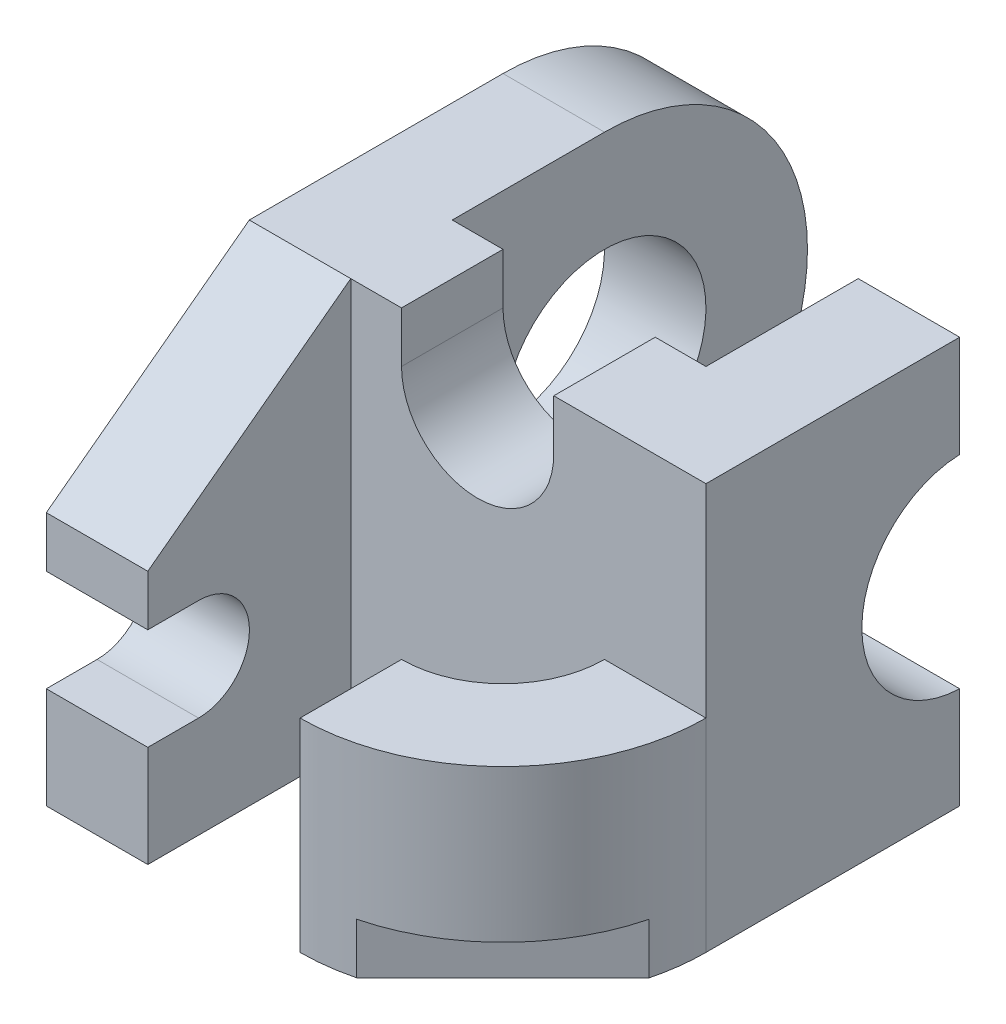
ISO-10303-21;
HEADER;
FILE_DESCRIPTION(('STEP AP214'),'2;1');
FILE_NAME('part.step','',(''),(''),'','','');
FILE_SCHEMA(('AUTOMOTIVE_DESIGN { 1 0 10303 214 1 1 1 1 }'));
ENDSEC;
DATA;
#1=APPLICATION_CONTEXT('core data for automotive mechanical design processes');
#2=APPLICATION_PROTOCOL_DEFINITION('international standard','automotive_design',2000,#1);
#3=PRODUCT_CONTEXT('',#1,'mechanical');
#4=PRODUCT('Part','Part','',(#3));
#5=PRODUCT_RELATED_PRODUCT_CATEGORY('part','',(#4));
#6=PRODUCT_DEFINITION_FORMATION('','',#4);
#7=PRODUCT_DEFINITION_CONTEXT('part definition',#1,'design');
#8=PRODUCT_DEFINITION('design','',#6,#7);
#9=PRODUCT_DEFINITION_SHAPE('','',#8);
#10=(LENGTH_UNIT() NAMED_UNIT(*) SI_UNIT(.MILLI.,.METRE.));
#11=(NAMED_UNIT(*) PLANE_ANGLE_UNIT() SI_UNIT($,.RADIAN.));
#12=(NAMED_UNIT(*) SI_UNIT($,.STERADIAN.) SOLID_ANGLE_UNIT());
#13=UNCERTAINTY_MEASURE_WITH_UNIT(LENGTH_MEASURE(1.E-05),#10,'distance_accuracy_value','');
#14=(GEOMETRIC_REPRESENTATION_CONTEXT(3) GLOBAL_UNCERTAINTY_ASSIGNED_CONTEXT((#13)) GLOBAL_UNIT_ASSIGNED_CONTEXT((#10,
#11,#12)) REPRESENTATION_CONTEXT('',''));
#15=CARTESIAN_POINT('',(0.,0.,0.));
#16=DIRECTION('',(0.,0.,1.));
#17=DIRECTION('',(1.,0.,0.));
#18=AXIS2_PLACEMENT_3D('',#15,#16,#17);
#19=CARTESIAN_POINT('',(-1.5,-1.,2.));
#20=DIRECTION('',(0.,0.,1.));
#21=DIRECTION('',(1.,0.,0.));
#22=AXIS2_PLACEMENT_3D('',#19,#20,#21);
#23=PLANE('',#22);
#24=DIRECTION('',(0.,-1.,0.));
#25=VECTOR('',#24,1.);
#26=CARTESIAN_POINT('',(1.,-4.,2.));
#27=LINE('',#26,#25);
#28=CARTESIAN_POINT('',(1.,-4.,2.));
#29=VERTEX_POINT('',#28);
#30=CARTESIAN_POINT('',(1.,-8.,2.));
#31=VERTEX_POINT('',#30);
#32=EDGE_CURVE('E57',#29,#31,#27,.T.);
#33=ORIENTED_EDGE('',*,*,#32,.F.);
#34=DIRECTION('',(1.,0.,0.));
#35=VECTOR('',#34,1.);
#36=CARTESIAN_POINT('',(3.,-4.,2.));
#37=LINE('',#36,#35);
#38=CARTESIAN_POINT('',(3.,-4.,2.));
#39=VERTEX_POINT('',#38);
#40=EDGE_CURVE('E237',#29,#39,#37,.T.);
#41=ORIENTED_EDGE('',*,*,#40,.T.);
#42=DIRECTION('',(0.,1.,0.));
#43=VECTOR('',#42,1.);
#44=CARTESIAN_POINT('',(3.,-8.,2.));
#45=LINE('',#44,#43);
#46=CARTESIAN_POINT('',(3.,0.,2.));
#47=VERTEX_POINT('',#46);
#48=EDGE_CURVE('E309',#39,#47,#45,.T.);
#49=ORIENTED_EDGE('',*,*,#48,.T.);
#50=DIRECTION('',(-1.,0.,0.));
#51=VECTOR('',#50,1.);
#52=CARTESIAN_POINT('',(3.,0.,2.));
#53=LINE('',#52,#51);
#54=CARTESIAN_POINT('',(0.,0.,2.));
#55=VERTEX_POINT('',#54);
#56=EDGE_CURVE('E326',#47,#55,#53,.T.);
#57=ORIENTED_EDGE('',*,*,#56,.T.);
#58=DIRECTION('',(0.,-1.,0.));
#59=VECTOR('',#58,1.);
#60=CARTESIAN_POINT('',(0.,0.,2.));
#61=LINE('',#60,#59);
#62=CARTESIAN_POINT('',(0.,-1.,2.));
#63=VERTEX_POINT('',#62);
#64=EDGE_CURVE('E328',#55,#63,#61,.T.);
#65=ORIENTED_EDGE('',*,*,#64,.T.);
#66=CARTESIAN_POINT('',(-1.5,-1.,2.));
#67=DIRECTION('',(0.,0.,-1.));
#68=DIRECTION('',(1.,0.,0.));
#69=AXIS2_PLACEMENT_3D('',#66,#67,#68);
#70=CIRCLE('',#69,1.5);
#71=CARTESIAN_POINT('',(-3.,-1.,2.));
#72=VERTEX_POINT('',#71);
#73=EDGE_CURVE('E330',#63,#72,#70,.T.);
#74=ORIENTED_EDGE('',*,*,#73,.T.);
#75=DIRECTION('',(0.,1.,0.));
#76=VECTOR('',#75,1.);
#77=CARTESIAN_POINT('',(-3.,0.,2.));
#78=LINE('',#77,#76);
#79=CARTESIAN_POINT('',(-3.,0.,2.));
#80=VERTEX_POINT('',#79);
#81=EDGE_CURVE('E305',#72,#80,#78,.T.);
#82=ORIENTED_EDGE('',*,*,#81,.T.);
#83=DIRECTION('',(-1.,0.,0.));
#84=VECTOR('',#83,1.);
#85=CARTESIAN_POINT('',(-3.,0.,2.));
#86=LINE('',#85,#84);
#87=CARTESIAN_POINT('',(-4.,0.,2.));
#88=VERTEX_POINT('',#87);
#89=EDGE_CURVE('E300',#80,#88,#86,.T.);
#90=ORIENTED_EDGE('',*,*,#89,.T.);
#91=DIRECTION('',(0.,-1.,0.));
#92=VECTOR('',#91,1.);
#93=CARTESIAN_POINT('',(-4.,-8.,2.));
#94=LINE('',#93,#92);
#95=CARTESIAN_POINT('',(-4.,-8.,2.));
#96=VERTEX_POINT('',#95);
#97=EDGE_CURVE('E274',#88,#96,#94,.T.);
#98=ORIENTED_EDGE('',*,*,#97,.T.);
#99=DIRECTION('',(1.,0.,0.));
#100=VECTOR('',#99,1.);
#101=CARTESIAN_POINT('',(-6.,-8.,2.));
#102=LINE('',#101,#100);
#103=EDGE_CURVE('E307',#96,#31,#102,.T.);
#104=ORIENTED_EDGE('',*,*,#103,.T.);
#105=EDGE_LOOP('',(#33,#41,#49,#57,#65,#74,#82,#90,#98,#104));
#106=FACE_BOUND('',#105,.T.);
#107=ADVANCED_FACE('F33',(#106),#23,.T.);
#108=CARTESIAN_POINT('',(-1.5,-1.,0.));
#109=DIRECTION('',(0.,0.,1.));
#110=DIRECTION('',(1.,0.,0.));
#111=AXIS2_PLACEMENT_3D('',#108,#109,#110);
#112=PLANE('',#111);
#113=DIRECTION('',(0.,1.,0.));
#114=VECTOR('',#113,1.);
#115=CARTESIAN_POINT('',(-4.,0.,0.));
#116=LINE('',#115,#114);
#117=CARTESIAN_POINT('',(-4.,-8.,0.));
#118=VERTEX_POINT('',#117);
#119=CARTESIAN_POINT('',(-4.,0.,0.));
#120=VERTEX_POINT('',#119);
#121=EDGE_CURVE('E449',#118,#120,#116,.T.);
#122=ORIENTED_EDGE('',*,*,#121,.T.);
#123=DIRECTION('',(-1.,0.,0.));
#124=VECTOR('',#123,1.);
#125=CARTESIAN_POINT('',(-3.,0.,0.));
#126=LINE('',#125,#124);
#127=CARTESIAN_POINT('',(-3.,0.,0.));
#128=VERTEX_POINT('',#127);
#129=EDGE_CURVE('E336',#128,#120,#126,.T.);
#130=ORIENTED_EDGE('',*,*,#129,.F.);
#131=DIRECTION('',(0.,1.,0.));
#132=VECTOR('',#131,1.);
#133=CARTESIAN_POINT('',(-3.,0.,0.));
#134=LINE('',#133,#132);
#135=CARTESIAN_POINT('',(-3.,-1.,0.));
#136=VERTEX_POINT('',#135);
#137=EDGE_CURVE('E333',#136,#128,#134,.T.);
#138=ORIENTED_EDGE('',*,*,#137,.F.);
#139=CARTESIAN_POINT('',(-1.5,-1.,0.));
#140=DIRECTION('',(0.,0.,-1.));
#141=DIRECTION('',(1.,0.,0.));
#142=AXIS2_PLACEMENT_3D('',#139,#140,#141);
#143=CIRCLE('',#142,1.5);
#144=CARTESIAN_POINT('',(0.,-1.,0.));
#145=VERTEX_POINT('',#144);
#146=EDGE_CURVE('E311',#145,#136,#143,.T.);
#147=ORIENTED_EDGE('',*,*,#146,.F.);
#148=DIRECTION('',(0.,-1.,0.));
#149=VECTOR('',#148,1.);
#150=CARTESIAN_POINT('',(0.,0.,0.));
#151=LINE('',#150,#149);
#152=CARTESIAN_POINT('',(0.,0.,0.));
#153=VERTEX_POINT('',#152);
#154=EDGE_CURVE('E342',#153,#145,#151,.T.);
#155=ORIENTED_EDGE('',*,*,#154,.F.);
#156=DIRECTION('',(-1.,0.,0.));
#157=VECTOR('',#156,1.);
#158=CARTESIAN_POINT('',(3.,0.,0.));
#159=LINE('',#158,#157);
#160=CARTESIAN_POINT('',(1.,0.,0.));
#161=VERTEX_POINT('',#160);
#162=EDGE_CURVE('E345',#161,#153,#159,.T.);
#163=ORIENTED_EDGE('',*,*,#162,.F.);
#164=DIRECTION('',(0.,-1.,0.));
#165=VECTOR('',#164,1.);
#166=CARTESIAN_POINT('',(1.,0.,0.));
#167=LINE('',#166,#165);
#168=CARTESIAN_POINT('',(1.,-8.,0.));
#169=VERTEX_POINT('',#168);
#170=EDGE_CURVE('E348',#161,#169,#167,.T.);
#171=ORIENTED_EDGE('',*,*,#170,.T.);
#172=DIRECTION('',(1.,0.,0.));
#173=VECTOR('',#172,1.);
#174=CARTESIAN_POINT('',(-6.,-8.,0.));
#175=LINE('',#174,#173);
#176=EDGE_CURVE('E315',#118,#169,#175,.T.);
#177=ORIENTED_EDGE('',*,*,#176,.F.);
#178=EDGE_LOOP('',(#122,#130,#138,#147,#155,#163,#171,#177));
#179=FACE_BOUND('',#178,.T.);
#180=ADVANCED_FACE('F404',(#179),#112,.F.);
#181=CARTESIAN_POINT('',(-3.,0.,2.));
#182=DIRECTION('',(-1.,0.,0.));
#183=DIRECTION('',(0.,-1.,0.));
#184=AXIS2_PLACEMENT_3D('',#181,#182,#183);
#185=PLANE('',#184);
#186=ORIENTED_EDGE('',*,*,#137,.T.);
#187=DIRECTION('',(0.,0.,-1.));
#188=VECTOR('',#187,1.);
#189=CARTESIAN_POINT('',(-3.,0.,2.));
#190=LINE('',#189,#188);
#191=EDGE_CURVE('E11',#80,#128,#190,.T.);
#192=ORIENTED_EDGE('',*,*,#191,.F.);
#193=ORIENTED_EDGE('',*,*,#81,.F.);
#194=DIRECTION('',(0.,0.,-1.));
#195=VECTOR('',#194,1.);
#196=CARTESIAN_POINT('',(-3.,-1.,2.));
#197=LINE('',#196,#195);
#198=EDGE_CURVE('E332',#72,#136,#197,.T.);
#199=ORIENTED_EDGE('',*,*,#198,.T.);
#200=EDGE_LOOP('',(#186,#192,#193,#199));
#201=FACE_BOUND('',#200,.T.);
#202=ADVANCED_FACE('F35',(#201),#185,.F.);
#203=CARTESIAN_POINT('',(-3.,0.,2.));
#204=DIRECTION('',(0.,-1.,0.));
#205=DIRECTION('',(1.,0.,0.));
#206=AXIS2_PLACEMENT_3D('',#203,#204,#205);
#207=PLANE('',#206);
#208=ORIENTED_EDGE('',*,*,#129,.T.);
#209=DIRECTION('',(0.,0.,-1.));
#210=VECTOR('',#209,1.);
#211=CARTESIAN_POINT('',(-4.,0.,-3.));
#212=LINE('',#211,#210);
#213=CARTESIAN_POINT('',(-4.,0.,-3.));
#214=VERTEX_POINT('',#213);
#215=EDGE_CURVE('E433',#120,#214,#212,.T.);
#216=ORIENTED_EDGE('',*,*,#215,.T.);
#217=DIRECTION('',(-1.,0.,0.));
#218=VECTOR('',#217,1.);
#219=CARTESIAN_POINT('',(-4.,0.,-3.));
#220=LINE('',#219,#218);
#221=CARTESIAN_POINT('',(-6.,0.,-3.));
#222=VERTEX_POINT('',#221);
#223=EDGE_CURVE('E374',#214,#222,#220,.T.);
#224=ORIENTED_EDGE('',*,*,#223,.T.);
#225=DIRECTION('',(0.,0.,-1.));
#226=VECTOR('',#225,1.);
#227=CARTESIAN_POINT('',(-6.,0.,2.));
#228=LINE('',#227,#226);
#229=CARTESIAN_POINT('',(-6.,0.,2.));
#230=VERTEX_POINT('',#229);
#231=EDGE_CURVE('E42',#230,#222,#228,.T.);
#232=ORIENTED_EDGE('',*,*,#231,.F.);
#233=DIRECTION('',(-1.,0.,0.));
#234=VECTOR('',#233,1.);
#235=CARTESIAN_POINT('',(-4.,0.,2.));
#236=LINE('',#235,#234);
#237=EDGE_CURVE('E281',#88,#230,#236,.T.);
#238=ORIENTED_EDGE('',*,*,#237,.F.);
#239=ORIENTED_EDGE('',*,*,#89,.F.);
#240=ORIENTED_EDGE('',*,*,#191,.T.);
#241=EDGE_LOOP('',(#208,#216,#224,#232,#238,#239,#240));
#242=FACE_BOUND('',#241,.T.);
#243=ADVANCED_FACE('F299',(#242),#207,.F.);
#244=CARTESIAN_POINT('',(-6.,0.,2.));
#245=DIRECTION('',(1.,0.,0.));
#246=DIRECTION('',(0.,1.,0.));
#247=AXIS2_PLACEMENT_3D('',#244,#245,#246);
#248=PLANE('',#247);
#249=ORIENTED_EDGE('',*,*,#231,.T.);
#250=CARTESIAN_POINT('',(-6.,-4.,-3.));
#251=DIRECTION('',(-1.,0.,0.));
#252=DIRECTION('',(0.,-1.,0.));
#253=AXIS2_PLACEMENT_3D('',#250,#251,#252);
#254=CIRCLE('',#253,4.);
#255=CARTESIAN_POINT('',(-6.,-8.,-3.));
#256=VERTEX_POINT('',#255);
#257=EDGE_CURVE('E430',#222,#256,#254,.T.);
#258=ORIENTED_EDGE('',*,*,#257,.T.);
#259=DIRECTION('',(0.,0.,-1.));
#260=VECTOR('',#259,1.);
#261=CARTESIAN_POINT('',(-6.,-8.,2.));
#262=LINE('',#261,#260);
#263=CARTESIAN_POINT('',(-6.,-8.,6.));
#264=VERTEX_POINT('',#263);
#265=EDGE_CURVE('E424',#264,#256,#262,.T.);
#266=ORIENTED_EDGE('',*,*,#265,.F.);
#267=DIRECTION('',(0.,1.,0.));
#268=VECTOR('',#267,1.);
#269=CARTESIAN_POINT('',(-6.,-8.,6.));
#270=LINE('',#269,#268);
#271=CARTESIAN_POINT('',(-6.,-6.,6.));
#272=VERTEX_POINT('',#271);
#273=EDGE_CURVE('E249',#264,#272,#270,.T.);
#274=ORIENTED_EDGE('',*,*,#273,.T.);
#275=DIRECTION('',(0.,0.,-1.));
#276=VECTOR('',#275,1.);
#277=CARTESIAN_POINT('',(-6.,-6.,6.));
#278=LINE('',#277,#276);
#279=CARTESIAN_POINT('',(-6.,-6.,5.));
#280=VERTEX_POINT('',#279);
#281=EDGE_CURVE('E474',#272,#280,#278,.T.);
#282=ORIENTED_EDGE('',*,*,#281,.T.);
#283=CARTESIAN_POINT('',(-6.,-4.99719330203454,5.));
#284=DIRECTION('',(1.,0.,0.));
#285=DIRECTION('',(0.,-1.,0.));
#286=AXIS2_PLACEMENT_3D('',#283,#284,#285);
#287=CIRCLE('',#286,1.00280669796546);
#288=CARTESIAN_POINT('',(-6.,-3.99438660406909,5.));
#289=VERTEX_POINT('',#288);
#290=EDGE_CURVE('E472',#280,#289,#287,.T.);
#291=ORIENTED_EDGE('',*,*,#290,.T.);
#292=DIRECTION('',(0.,0.,1.));
#293=VECTOR('',#292,1.);
#294=CARTESIAN_POINT('',(-6.,-3.99438660406909,6.));
#295=LINE('',#294,#293);
#296=CARTESIAN_POINT('',(-6.,-3.99438660406909,6.));
#297=VERTEX_POINT('',#296);
#298=EDGE_CURVE('E469',#289,#297,#295,.T.);
#299=ORIENTED_EDGE('',*,*,#298,.T.);
#300=DIRECTION('',(0.,1.,0.));
#301=VECTOR('',#300,1.);
#302=CARTESIAN_POINT('',(-6.,-2.99438660406909,6.));
#303=LINE('',#302,#301);
#304=CARTESIAN_POINT('',(-6.,-2.99438660406909,6.));
#305=VERTEX_POINT('',#304);
#306=EDGE_CURVE('E467',#297,#305,#303,.T.);
#307=ORIENTED_EDGE('',*,*,#306,.T.);
#308=DIRECTION('',(0.,0.59928075896345,-0.800538925934393));
#309=VECTOR('',#308,1.);
#310=CARTESIAN_POINT('',(-6.,0.,2.));
#311=LINE('',#310,#309);
#312=EDGE_CURVE('E257',#305,#230,#311,.T.);
#313=ORIENTED_EDGE('',*,*,#312,.T.);
#314=EDGE_LOOP('',(#249,#258,#266,#274,#282,#291,#299,#307,#313));
#315=FACE_BOUND('',#314,.T.);
#316=CARTESIAN_POINT('',(-6.,-4.,-3.));
#317=DIRECTION('',(-1.,0.,0.));
#318=DIRECTION('',(0.,-1.,0.));
#319=AXIS2_PLACEMENT_3D('',#316,#317,#318);
#320=CIRCLE('',#319,2.);
#321=CARTESIAN_POINT('',(-6.,-6.,-3.));
#322=VERTEX_POINT('',#321);
#323=EDGE_CURVE('E445',#322,#322,#320,.T.);
#324=ORIENTED_EDGE('',*,*,#323,.F.);
#325=EDGE_LOOP('',(#324));
#326=FACE_BOUND('',#325,.T.);
#327=ADVANCED_FACE('F427',(#315,#326),#248,.F.);
#328=CARTESIAN_POINT('',(-6.,-8.,2.));
#329=DIRECTION('',(0.,1.,0.));
#330=DIRECTION('',(0.,0.,1.));
#331=AXIS2_PLACEMENT_3D('',#328,#329,#330);
#332=PLANE('',#331);
#333=CARTESIAN_POINT('',(-1.00000000000002,-8.,1.99999999999998));
#334=DIRECTION('',(0.,-1.,0.));
#335=DIRECTION('',(0.,0.,1.));
#336=AXIS2_PLACEMENT_3D('',#333,#334,#335);
#337=CIRCLE('',#336,4.00000000000002);
#338=CARTESIAN_POINT('',(3.,-8.,2.));
#339=VERTEX_POINT('',#338);
#340=CARTESIAN_POINT('',(2.87298334620742,-8.,2.99999999999998));
#341=VERTEX_POINT('',#340);
#342=EDGE_CURVE('E240',#339,#341,#337,.T.);
#343=ORIENTED_EDGE('',*,*,#342,.T.);
#344=DIRECTION('',(0.70782222041372,0.,-0.706390617356));
#345=VECTOR('',#344,1.);
#346=CARTESIAN_POINT('',(-0.0078432583507787,-8.,5.87499999999999));
#347=LINE('',#346,#345);
#348=CARTESIAN_POINT('',(-0.0078432583507787,-8.,5.87499999999999));
#349=VERTEX_POINT('',#348);
#350=EDGE_CURVE('E212',#349,#341,#347,.T.);
#351=ORIENTED_EDGE('',*,*,#350,.F.);
#352=CARTESIAN_POINT('',(-1.,-8.,6.));
#353=VERTEX_POINT('',#352);
#354=EDGE_CURVE('E223',#349,#353,#337,.T.);
#355=ORIENTED_EDGE('',*,*,#354,.T.);
#356=DIRECTION('',(0.,0.,-1.));
#357=VECTOR('',#356,1.);
#358=CARTESIAN_POINT('',(-1.,-8.,6.));
#359=LINE('',#358,#357);
#360=CARTESIAN_POINT('',(-0.999999999999999,-8.,4.));
#361=VERTEX_POINT('',#360);
#362=EDGE_CURVE('E243',#353,#361,#359,.T.);
#363=ORIENTED_EDGE('',*,*,#362,.T.);
#364=CARTESIAN_POINT('',(-1.,-8.,2.));
#365=DIRECTION('',(0.,1.,0.));
#366=DIRECTION('',(0.,0.,-1.));
#367=AXIS2_PLACEMENT_3D('',#364,#365,#366);
#368=CIRCLE('',#367,2.);
#369=EDGE_CURVE('E232',#361,#31,#368,.T.);
#370=ORIENTED_EDGE('',*,*,#369,.T.);
#371=ORIENTED_EDGE('',*,*,#103,.F.);
#372=DIRECTION('',(0.,0.,1.));
#373=VECTOR('',#372,1.);
#374=CARTESIAN_POINT('',(-4.,-8.,6.));
#375=LINE('',#374,#373);
#376=CARTESIAN_POINT('',(-4.,-8.,6.));
#377=VERTEX_POINT('',#376);
#378=EDGE_CURVE('E278',#96,#377,#375,.T.);
#379=ORIENTED_EDGE('',*,*,#378,.T.);
#380=DIRECTION('',(-1.,0.,0.));
#381=VECTOR('',#380,1.);
#382=CARTESIAN_POINT('',(-4.,-8.,6.));
#383=LINE('',#382,#381);
#384=EDGE_CURVE('E283',#377,#264,#383,.T.);
#385=ORIENTED_EDGE('',*,*,#384,.T.);
#386=ORIENTED_EDGE('',*,*,#265,.T.);
#387=DIRECTION('',(-1.,0.,0.));
#388=VECTOR('',#387,1.);
#389=CARTESIAN_POINT('',(-4.,-8.,-3.));
#390=LINE('',#389,#388);
#391=CARTESIAN_POINT('',(-4.,-8.,-3.));
#392=VERTEX_POINT('',#391);
#393=EDGE_CURVE('E358',#392,#256,#390,.T.);
#394=ORIENTED_EDGE('',*,*,#393,.F.);
#395=DIRECTION('',(0.,0.,1.));
#396=VECTOR('',#395,1.);
#397=CARTESIAN_POINT('',(-4.,-8.,0.));
#398=LINE('',#397,#396);
#399=EDGE_CURVE('E442',#392,#118,#398,.T.);
#400=ORIENTED_EDGE('',*,*,#399,.T.);
#401=ORIENTED_EDGE('',*,*,#176,.T.);
#402=DIRECTION('',(0.,0.,-1.));
#403=VECTOR('',#402,1.);
#404=CARTESIAN_POINT('',(1.,-8.,0.));
#405=LINE('',#404,#403);
#406=CARTESIAN_POINT('',(1.,-8.,-3.));
#407=VERTEX_POINT('',#406);
#408=EDGE_CURVE('E352',#169,#407,#405,.T.);
#409=ORIENTED_EDGE('',*,*,#408,.T.);
#410=DIRECTION('',(1.,0.,0.));
#411=VECTOR('',#410,1.);
#412=CARTESIAN_POINT('',(1.,-8.,-3.));
#413=LINE('',#412,#411);
#414=CARTESIAN_POINT('',(3.,-8.,-3.));
#415=VERTEX_POINT('',#414);
#416=EDGE_CURVE('E384',#407,#415,#413,.T.);
#417=ORIENTED_EDGE('',*,*,#416,.T.);
#418=DIRECTION('',(0.,0.,-1.));
#419=VECTOR('',#418,1.);
#420=CARTESIAN_POINT('',(3.,-8.,2.));
#421=LINE('',#420,#419);
#422=EDGE_CURVE('E422',#339,#415,#421,.T.);
#423=ORIENTED_EDGE('',*,*,#422,.F.);
#424=EDGE_LOOP('',(#343,#351,#355,#363,#370,#371,#379,#385,#386,#394,#400,#401,#409,#417,#423));
#425=FACE_BOUND('',#424,.T.);
#426=ADVANCED_FACE('F498',(#425),#332,.F.);
#427=CARTESIAN_POINT('',(3.,-8.,2.));
#428=DIRECTION('',(-1.,0.,0.));
#429=DIRECTION('',(0.,0.,1.));
#430=AXIS2_PLACEMENT_3D('',#427,#428,#429);
#431=PLANE('',#430);
#432=ORIENTED_EDGE('',*,*,#422,.T.);
#433=DIRECTION('',(0.,1.,0.));
#434=VECTOR('',#433,1.);
#435=CARTESIAN_POINT('',(3.,-8.,-3.));
#436=LINE('',#435,#434);
#437=CARTESIAN_POINT('',(3.,-6.,-3.));
#438=VERTEX_POINT('',#437);
#439=EDGE_CURVE('E370',#415,#438,#436,.T.);
#440=ORIENTED_EDGE('',*,*,#439,.T.);
#441=CARTESIAN_POINT('',(3.,-4.00128685096929,-3.07173386851244));
#442=DIRECTION('',(-1.,0.,0.));
#443=DIRECTION('',(0.,0.,-1.));
#444=AXIS2_PLACEMENT_3D('',#441,#442,#443);
#445=CIRCLE('',#444,2.);
#446=CARTESIAN_POINT('',(3.,-2.00257370193859,-3.));
#447=VERTEX_POINT('',#446);
#448=EDGE_CURVE('E373',#438,#447,#445,.T.);
#449=ORIENTED_EDGE('',*,*,#448,.T.);
#450=DIRECTION('',(0.,1.,0.));
#451=VECTOR('',#450,1.);
#452=CARTESIAN_POINT('',(3.,0.,-3.));
#453=LINE('',#452,#451);
#454=CARTESIAN_POINT('',(3.,0.,-3.));
#455=VERTEX_POINT('',#454);
#456=EDGE_CURVE('E353',#447,#455,#453,.T.);
#457=ORIENTED_EDGE('',*,*,#456,.T.);
#458=DIRECTION('',(0.,0.,-1.));
#459=VECTOR('',#458,1.);
#460=CARTESIAN_POINT('',(3.,0.,2.));
#461=LINE('',#460,#459);
#462=EDGE_CURVE('E420',#47,#455,#461,.T.);
#463=ORIENTED_EDGE('',*,*,#462,.F.);
#464=ORIENTED_EDGE('',*,*,#48,.F.);
#465=EDGE_CURVE('E323',#339,#39,#45,.T.);
#466=ORIENTED_EDGE('',*,*,#465,.F.);
#467=EDGE_LOOP('',(#432,#440,#449,#457,#463,#464,#466));
#468=FACE_BOUND('',#467,.T.);
#469=ADVANCED_FACE('F512',(#468),#431,.F.);
#470=CARTESIAN_POINT('',(3.,0.,2.));
#471=DIRECTION('',(0.,-1.,0.));
#472=DIRECTION('',(1.,0.,0.));
#473=AXIS2_PLACEMENT_3D('',#470,#471,#472);
#474=PLANE('',#473);
#475=ORIENTED_EDGE('',*,*,#462,.T.);
#476=DIRECTION('',(1.,0.,0.));
#477=VECTOR('',#476,1.);
#478=CARTESIAN_POINT('',(1.,0.,-3.));
#479=LINE('',#478,#477);
#480=CARTESIAN_POINT('',(1.,0.,-3.));
#481=VERTEX_POINT('',#480);
#482=EDGE_CURVE('E337',#481,#455,#479,.T.);
#483=ORIENTED_EDGE('',*,*,#482,.F.);
#484=DIRECTION('',(0.,0.,1.));
#485=VECTOR('',#484,1.);
#486=CARTESIAN_POINT('',(1.,0.,0.));
#487=LINE('',#486,#485);
#488=EDGE_CURVE('E369',#481,#161,#487,.T.);
#489=ORIENTED_EDGE('',*,*,#488,.T.);
#490=ORIENTED_EDGE('',*,*,#162,.T.);
#491=DIRECTION('',(0.,0.,-1.));
#492=VECTOR('',#491,1.);
#493=CARTESIAN_POINT('',(0.,0.,2.));
#494=LINE('',#493,#492);
#495=EDGE_CURVE('E418',#55,#153,#494,.T.);
#496=ORIENTED_EDGE('',*,*,#495,.F.);
#497=ORIENTED_EDGE('',*,*,#56,.F.);
#498=EDGE_LOOP('',(#475,#483,#489,#490,#496,#497));
#499=FACE_BOUND('',#498,.T.);
#500=ADVANCED_FACE('F396',(#499),#474,.F.);
#501=CARTESIAN_POINT('',(0.,0.,2.));
#502=DIRECTION('',(1.,0.,0.));
#503=DIRECTION('',(0.,1.,0.));
#504=AXIS2_PLACEMENT_3D('',#501,#502,#503);
#505=PLANE('',#504);
#506=ORIENTED_EDGE('',*,*,#154,.T.);
#507=DIRECTION('',(0.,0.,-1.));
#508=VECTOR('',#507,1.);
#509=CARTESIAN_POINT('',(0.,-1.,2.));
#510=LINE('',#509,#508);
#511=EDGE_CURVE('E416',#63,#145,#510,.T.);
#512=ORIENTED_EDGE('',*,*,#511,.F.);
#513=ORIENTED_EDGE('',*,*,#64,.F.);
#514=ORIENTED_EDGE('',*,*,#495,.T.);
#515=EDGE_LOOP('',(#506,#512,#513,#514));
#516=FACE_BOUND('',#515,.T.);
#517=ADVANCED_FACE('F517',(#516),#505,.F.);
#518=CARTESIAN_POINT('',(-1.5,-1.,2.));
#519=DIRECTION('',(0.,0.,-1.));
#520=DIRECTION('',(-1.,0.,0.));
#521=AXIS2_PLACEMENT_3D('',#518,#519,#520);
#522=CYLINDRICAL_SURFACE('',#521,1.5);
#523=ORIENTED_EDGE('',*,*,#146,.T.);
#524=ORIENTED_EDGE('',*,*,#198,.F.);
#525=ORIENTED_EDGE('',*,*,#73,.F.);
#526=ORIENTED_EDGE('',*,*,#511,.T.);
#527=EDGE_LOOP('',(#523,#524,#525,#526));
#528=FACE_BOUND('',#527,.T.);
#529=ADVANCED_FACE('F518',(#528),#522,.F.);
#530=CARTESIAN_POINT('',(1.,0.,-3.));
#531=DIRECTION('',(0.,0.,-1.));
#532=DIRECTION('',(0.,1.,0.));
#533=AXIS2_PLACEMENT_3D('',#530,#531,#532);
#534=PLANE('',#533);
#535=ORIENTED_EDGE('',*,*,#456,.F.);
#536=DIRECTION('',(1.,0.,0.));
#537=VECTOR('',#536,1.);
#538=CARTESIAN_POINT('',(1.,-2.00257370193859,-3.));
#539=LINE('',#538,#537);
#540=CARTESIAN_POINT('',(1.,-2.00257370193859,-3.));
#541=VERTEX_POINT('',#540);
#542=EDGE_CURVE('E381',#541,#447,#539,.T.);
#543=ORIENTED_EDGE('',*,*,#542,.F.);
#544=DIRECTION('',(0.,1.,0.));
#545=VECTOR('',#544,1.);
#546=CARTESIAN_POINT('',(1.,0.,-3.));
#547=LINE('',#546,#545);
#548=EDGE_CURVE('E366',#541,#481,#547,.T.);
#549=ORIENTED_EDGE('',*,*,#548,.T.);
#550=ORIENTED_EDGE('',*,*,#482,.T.);
#551=EDGE_LOOP('',(#535,#543,#549,#550));
#552=FACE_BOUND('',#551,.T.);
#553=ADVANCED_FACE('F533',(#552),#534,.T.);
#554=CARTESIAN_POINT('',(1.,-4.00128685096929,-3.07173386851244));
#555=DIRECTION('',(1.,0.,0.));
#556=DIRECTION('',(0.,0.,-1.));
#557=AXIS2_PLACEMENT_3D('',#554,#555,#556);
#558=CYLINDRICAL_SURFACE('',#557,2.);
#559=ORIENTED_EDGE('',*,*,#448,.F.);
#560=DIRECTION('',(1.,0.,0.));
#561=VECTOR('',#560,1.);
#562=CARTESIAN_POINT('',(1.,-6.,-3.));
#563=LINE('',#562,#561);
#564=CARTESIAN_POINT('',(1.,-6.,-3.));
#565=VERTEX_POINT('',#564);
#566=EDGE_CURVE('E383',#565,#438,#563,.T.);
#567=ORIENTED_EDGE('',*,*,#566,.F.);
#568=CARTESIAN_POINT('',(1.,-4.00128685096929,-3.07173386851244));
#569=DIRECTION('',(-1.,0.,0.));
#570=DIRECTION('',(0.,0.,-1.));
#571=AXIS2_PLACEMENT_3D('',#568,#569,#570);
#572=CIRCLE('',#571,2.);
#573=EDGE_CURVE('E363',#565,#541,#572,.T.);
#574=ORIENTED_EDGE('',*,*,#573,.T.);
#575=ORIENTED_EDGE('',*,*,#542,.T.);
#576=EDGE_LOOP('',(#559,#567,#574,#575));
#577=FACE_BOUND('',#576,.T.);
#578=ADVANCED_FACE('F531',(#577),#558,.F.);
#579=CARTESIAN_POINT('',(1.,-8.,-3.));
#580=DIRECTION('',(0.,0.,-1.));
#581=DIRECTION('',(-1.,0.,0.));
#582=AXIS2_PLACEMENT_3D('',#579,#580,#581);
#583=PLANE('',#582);
#584=ORIENTED_EDGE('',*,*,#439,.F.);
#585=ORIENTED_EDGE('',*,*,#416,.F.);
#586=DIRECTION('',(0.,1.,0.));
#587=VECTOR('',#586,1.);
#588=CARTESIAN_POINT('',(1.,-8.,-3.));
#589=LINE('',#588,#587);
#590=EDGE_CURVE('E360',#407,#565,#589,.T.);
#591=ORIENTED_EDGE('',*,*,#590,.T.);
#592=ORIENTED_EDGE('',*,*,#566,.T.);
#593=EDGE_LOOP('',(#584,#585,#591,#592));
#594=FACE_BOUND('',#593,.T.);
#595=ADVANCED_FACE('F528',(#594),#583,.T.);
#596=CARTESIAN_POINT('',(1.,-4.00128685096929,-3.07173386851244));
#597=DIRECTION('',(1.,0.,0.));
#598=DIRECTION('',(0.,0.,-1.));
#599=AXIS2_PLACEMENT_3D('',#596,#597,#598);
#600=PLANE('',#599);
#601=ORIENTED_EDGE('',*,*,#170,.F.);
#602=ORIENTED_EDGE('',*,*,#488,.F.);
#603=ORIENTED_EDGE('',*,*,#548,.F.);
#604=ORIENTED_EDGE('',*,*,#573,.F.);
#605=ORIENTED_EDGE('',*,*,#590,.F.);
#606=ORIENTED_EDGE('',*,*,#408,.F.);
#607=EDGE_LOOP('',(#601,#602,#603,#604,#605,#606));
#608=FACE_BOUND('',#607,.T.);
#609=ADVANCED_FACE('F525',(#608),#600,.F.);
#610=CARTESIAN_POINT('',(-4.,-4.,-3.));
#611=DIRECTION('',(-1.,0.,0.));
#612=DIRECTION('',(0.,-1.,0.));
#613=AXIS2_PLACEMENT_3D('',#610,#611,#612);
#614=CYLINDRICAL_SURFACE('',#613,4.);
#615=ORIENTED_EDGE('',*,*,#257,.F.);
#616=ORIENTED_EDGE('',*,*,#223,.F.);
#617=CARTESIAN_POINT('',(-4.,-4.,-3.));
#618=DIRECTION('',(-1.,0.,0.));
#619=DIRECTION('',(0.,-1.,0.));
#620=AXIS2_PLACEMENT_3D('',#617,#618,#619);
#621=CIRCLE('',#620,4.);
#622=EDGE_CURVE('E439',#214,#392,#621,.T.);
#623=ORIENTED_EDGE('',*,*,#622,.T.);
#624=ORIENTED_EDGE('',*,*,#393,.T.);
#625=EDGE_LOOP('',(#615,#616,#623,#624));
#626=FACE_BOUND('',#625,.T.);
#627=ADVANCED_FACE('F438',(#626),#614,.T.);
#628=CARTESIAN_POINT('',(-4.,-4.,-3.));
#629=DIRECTION('',(-1.,0.,0.));
#630=DIRECTION('',(0.,-1.,0.));
#631=AXIS2_PLACEMENT_3D('',#628,#629,#630);
#632=PLANE('',#631);
#633=CARTESIAN_POINT('',(-4.,-4.,-3.));
#634=DIRECTION('',(-1.,0.,0.));
#635=DIRECTION('',(0.,-1.,0.));
#636=AXIS2_PLACEMENT_3D('',#633,#634,#635);
#637=CIRCLE('',#636,2.);
#638=CARTESIAN_POINT('',(-4.,-6.,-3.));
#639=VERTEX_POINT('',#638);
#640=EDGE_CURVE('E440',#639,#639,#637,.T.);
#641=ORIENTED_EDGE('',*,*,#640,.T.);
#642=EDGE_LOOP('',(#641));
#643=FACE_BOUND('',#642,.T.);
#644=ORIENTED_EDGE('',*,*,#622,.F.);
#645=ORIENTED_EDGE('',*,*,#215,.F.);
#646=ORIENTED_EDGE('',*,*,#121,.F.);
#647=ORIENTED_EDGE('',*,*,#399,.F.);
#648=EDGE_LOOP('',(#644,#645,#646,#647));
#649=FACE_BOUND('',#648,.T.);
#650=ADVANCED_FACE('F522',(#643,#649),#632,.F.);
#651=CARTESIAN_POINT('',(-4.,-4.,-3.));
#652=DIRECTION('',(-1.,0.,0.));
#653=DIRECTION('',(0.,-1.,0.));
#654=AXIS2_PLACEMENT_3D('',#651,#652,#653);
#655=CYLINDRICAL_SURFACE('',#654,2.);
#656=ORIENTED_EDGE('',*,*,#640,.F.);
#657=EDGE_LOOP('',(#656));
#658=FACE_BOUND('',#657,.T.);
#659=ORIENTED_EDGE('',*,*,#323,.T.);
#660=EDGE_LOOP('',(#659));
#661=FACE_BOUND('',#660,.T.);
#662=ADVANCED_FACE('F595',(#658,#661),#655,.F.);
#663=CARTESIAN_POINT('',(-4.,-8.,6.));
#664=DIRECTION('',(0.,0.,1.));
#665=DIRECTION('',(1.,0.,0.));
#666=AXIS2_PLACEMENT_3D('',#663,#664,#665);
#667=PLANE('',#666);
#668=ORIENTED_EDGE('',*,*,#273,.F.);
#669=ORIENTED_EDGE('',*,*,#384,.F.);
#670=DIRECTION('',(0.,1.,0.));
#671=VECTOR('',#670,1.);
#672=CARTESIAN_POINT('',(-4.,-8.,6.));
#673=LINE('',#672,#671);
#674=CARTESIAN_POINT('',(-4.,-6.,6.));
#675=VERTEX_POINT('',#674);
#676=EDGE_CURVE('E253',#377,#675,#673,.T.);
#677=ORIENTED_EDGE('',*,*,#676,.T.);
#678=DIRECTION('',(-1.,0.,0.));
#679=VECTOR('',#678,1.);
#680=CARTESIAN_POINT('',(-4.,-6.,6.));
#681=LINE('',#680,#679);
#682=EDGE_CURVE('E455',#675,#272,#681,.T.);
#683=ORIENTED_EDGE('',*,*,#682,.T.);
#684=EDGE_LOOP('',(#668,#669,#677,#683));
#685=FACE_BOUND('',#684,.T.);
#686=ADVANCED_FACE('F480',(#685),#667,.T.);
#687=CARTESIAN_POINT('',(-4.,0.,2.));
#688=DIRECTION('',(0.,0.800538925934393,0.59928075896345));
#689=DIRECTION('',(0.,-0.59928075896345,0.800538925934393));
#690=AXIS2_PLACEMENT_3D('',#687,#688,#689);
#691=PLANE('',#690);
#692=ORIENTED_EDGE('',*,*,#312,.F.);
#693=DIRECTION('',(-1.,0.,0.));
#694=VECTOR('',#693,1.);
#695=CARTESIAN_POINT('',(-4.,-2.99438660406909,6.));
#696=LINE('',#695,#694);
#697=CARTESIAN_POINT('',(-4.,-2.99438660406909,6.));
#698=VERTEX_POINT('',#697);
#699=EDGE_CURVE('E284',#698,#305,#696,.T.);
#700=ORIENTED_EDGE('',*,*,#699,.F.);
#701=DIRECTION('',(0.,0.59928075896345,-0.800538925934393));
#702=VECTOR('',#701,1.);
#703=CARTESIAN_POINT('',(-4.,0.,2.));
#704=LINE('',#703,#702);
#705=EDGE_CURVE('E269',#698,#88,#704,.T.);
#706=ORIENTED_EDGE('',*,*,#705,.T.);
#707=ORIENTED_EDGE('',*,*,#237,.T.);
#708=EDGE_LOOP('',(#692,#700,#706,#707));
#709=FACE_BOUND('',#708,.T.);
#710=ADVANCED_FACE('F291',(#709),#691,.T.);
#711=CARTESIAN_POINT('',(-4.,-2.99438660406909,6.));
#712=DIRECTION('',(0.,0.,1.));
#713=DIRECTION('',(1.,0.,0.));
#714=AXIS2_PLACEMENT_3D('',#711,#712,#713);
#715=PLANE('',#714);
#716=ORIENTED_EDGE('',*,*,#306,.F.);
#717=DIRECTION('',(-1.,0.,0.));
#718=VECTOR('',#717,1.);
#719=CARTESIAN_POINT('',(-4.,-3.99438660406909,6.));
#720=LINE('',#719,#718);
#721=CARTESIAN_POINT('',(-4.,-3.99438660406909,6.));
#722=VERTEX_POINT('',#721);
#723=EDGE_CURVE('E461',#722,#297,#720,.T.);
#724=ORIENTED_EDGE('',*,*,#723,.F.);
#725=DIRECTION('',(0.,1.,0.));
#726=VECTOR('',#725,1.);
#727=CARTESIAN_POINT('',(-4.,-2.99438660406909,6.));
#728=LINE('',#727,#726);
#729=EDGE_CURVE('E266',#722,#698,#728,.T.);
#730=ORIENTED_EDGE('',*,*,#729,.T.);
#731=ORIENTED_EDGE('',*,*,#699,.T.);
#732=EDGE_LOOP('',(#716,#724,#730,#731));
#733=FACE_BOUND('',#732,.T.);
#734=ADVANCED_FACE('F495',(#733),#715,.T.);
#735=CARTESIAN_POINT('',(-4.,-3.99438660406909,6.));
#736=DIRECTION('',(0.,-1.,0.));
#737=DIRECTION('',(1.,0.,0.));
#738=AXIS2_PLACEMENT_3D('',#735,#736,#737);
#739=PLANE('',#738);
#740=ORIENTED_EDGE('',*,*,#298,.F.);
#741=DIRECTION('',(-1.,0.,0.));
#742=VECTOR('',#741,1.);
#743=CARTESIAN_POINT('',(-4.,-3.99438660406909,5.));
#744=LINE('',#743,#742);
#745=CARTESIAN_POINT('',(-4.,-3.99438660406909,5.));
#746=VERTEX_POINT('',#745);
#747=EDGE_CURVE('E459',#746,#289,#744,.T.);
#748=ORIENTED_EDGE('',*,*,#747,.F.);
#749=DIRECTION('',(0.,0.,1.));
#750=VECTOR('',#749,1.);
#751=CARTESIAN_POINT('',(-4.,-3.99438660406909,6.));
#752=LINE('',#751,#750);
#753=EDGE_CURVE('E263',#746,#722,#752,.T.);
#754=ORIENTED_EDGE('',*,*,#753,.T.);
#755=ORIENTED_EDGE('',*,*,#723,.T.);
#756=EDGE_LOOP('',(#740,#748,#754,#755));
#757=FACE_BOUND('',#756,.T.);
#758=ADVANCED_FACE('F492',(#757),#739,.T.);
#759=CARTESIAN_POINT('',(-4.,-4.99719330203454,5.));
#760=DIRECTION('',(-1.,0.,0.));
#761=DIRECTION('',(0.,-1.,0.));
#762=AXIS2_PLACEMENT_3D('',#759,#760,#761);
#763=CYLINDRICAL_SURFACE('',#762,1.00280669796546);
#764=ORIENTED_EDGE('',*,*,#290,.F.);
#765=DIRECTION('',(-1.,0.,0.));
#766=VECTOR('',#765,1.);
#767=CARTESIAN_POINT('',(-4.,-6.,5.));
#768=LINE('',#767,#766);
#769=CARTESIAN_POINT('',(-4.,-6.,5.));
#770=VERTEX_POINT('',#769);
#771=EDGE_CURVE('E457',#770,#280,#768,.T.);
#772=ORIENTED_EDGE('',*,*,#771,.F.);
#773=CARTESIAN_POINT('',(-4.,-4.99719330203454,5.));
#774=DIRECTION('',(1.,0.,0.));
#775=DIRECTION('',(0.,-1.,0.));
#776=AXIS2_PLACEMENT_3D('',#773,#774,#775);
#777=CIRCLE('',#776,1.00280669796546);
#778=EDGE_CURVE('E260',#770,#746,#777,.T.);
#779=ORIENTED_EDGE('',*,*,#778,.T.);
#780=ORIENTED_EDGE('',*,*,#747,.T.);
#781=EDGE_LOOP('',(#764,#772,#779,#780));
#782=FACE_BOUND('',#781,.T.);
#783=ADVANCED_FACE('F488',(#782),#763,.F.);
#784=CARTESIAN_POINT('',(-4.,-6.,6.));
#785=DIRECTION('',(0.,1.,0.));
#786=DIRECTION('',(-1.,0.,0.));
#787=AXIS2_PLACEMENT_3D('',#784,#785,#786);
#788=PLANE('',#787);
#789=ORIENTED_EDGE('',*,*,#281,.F.);
#790=ORIENTED_EDGE('',*,*,#682,.F.);
#791=DIRECTION('',(0.,0.,-1.));
#792=VECTOR('',#791,1.);
#793=CARTESIAN_POINT('',(-4.,-6.,6.));
#794=LINE('',#793,#792);
#795=EDGE_CURVE('E256',#675,#770,#794,.T.);
#796=ORIENTED_EDGE('',*,*,#795,.T.);
#797=ORIENTED_EDGE('',*,*,#771,.T.);
#798=EDGE_LOOP('',(#789,#790,#796,#797));
#799=FACE_BOUND('',#798,.T.);
#800=ADVANCED_FACE('F484',(#799),#788,.T.);
#801=CARTESIAN_POINT('',(-4.,-4.99719330203454,5.));
#802=DIRECTION('',(-1.,0.,0.));
#803=DIRECTION('',(0.,-1.,0.));
#804=AXIS2_PLACEMENT_3D('',#801,#802,#803);
#805=PLANE('',#804);
#806=ORIENTED_EDGE('',*,*,#676,.F.);
#807=ORIENTED_EDGE('',*,*,#378,.F.);
#808=ORIENTED_EDGE('',*,*,#97,.F.);
#809=ORIENTED_EDGE('',*,*,#705,.F.);
#810=ORIENTED_EDGE('',*,*,#729,.F.);
#811=ORIENTED_EDGE('',*,*,#753,.F.);
#812=ORIENTED_EDGE('',*,*,#778,.F.);
#813=ORIENTED_EDGE('',*,*,#795,.F.);
#814=EDGE_LOOP('',(#806,#807,#808,#809,#810,#811,#812,#813));
#815=FACE_BOUND('',#814,.T.);
#816=ADVANCED_FACE('F496',(#815),#805,.F.);
#817=CARTESIAN_POINT('',(-1.00000000000002,-4.,1.99999999999998));
#818=DIRECTION('',(0.,-1.,0.));
#819=DIRECTION('',(0.,0.,-1.));
#820=AXIS2_PLACEMENT_3D('',#817,#818,#819);
#821=CYLINDRICAL_SURFACE('',#820,4.00000000000002);
#822=DIRECTION('',(0.,-1.,0.));
#823=VECTOR('',#822,1.);
#824=CARTESIAN_POINT('',(2.87298334620742,-7.,2.99999999999998));
#825=LINE('',#824,#823);
#826=CARTESIAN_POINT('',(2.87298334620742,-7.,2.99999999999998));
#827=VERTEX_POINT('',#826);
#828=EDGE_CURVE('E218',#827,#341,#825,.T.);
#829=ORIENTED_EDGE('',*,*,#828,.T.);
#830=ORIENTED_EDGE('',*,*,#342,.F.);
#831=ORIENTED_EDGE('',*,*,#465,.T.);
#832=CARTESIAN_POINT('',(-1.00000000000002,-4.,1.99999999999998));
#833=DIRECTION('',(0.,-1.,0.));
#834=DIRECTION('',(0.,0.,1.));
#835=AXIS2_PLACEMENT_3D('',#832,#833,#834);
#836=CIRCLE('',#835,4.00000000000002);
#837=CARTESIAN_POINT('',(-1.,-4.,6.));
#838=VERTEX_POINT('',#837);
#839=EDGE_CURVE('E228',#39,#838,#836,.T.);
#840=ORIENTED_EDGE('',*,*,#839,.T.);
#841=DIRECTION('',(0.,-1.,0.));
#842=VECTOR('',#841,1.);
#843=CARTESIAN_POINT('',(-1.,-4.,6.));
#844=LINE('',#843,#842);
#845=EDGE_CURVE('E239',#838,#353,#844,.T.);
#846=ORIENTED_EDGE('',*,*,#845,.T.);
#847=ORIENTED_EDGE('',*,*,#354,.F.);
#848=DIRECTION('',(0.,-1.,0.));
#849=VECTOR('',#848,1.);
#850=CARTESIAN_POINT('',(-0.0078432583507787,-7.,5.87499999999999));
#851=LINE('',#850,#849);
#852=CARTESIAN_POINT('',(-0.0078432583507787,-7.,5.87499999999999));
#853=VERTEX_POINT('',#852);
#854=EDGE_CURVE('E216',#853,#349,#851,.T.);
#855=ORIENTED_EDGE('',*,*,#854,.F.);
#856=CARTESIAN_POINT('',(-1.00000000000002,-7.,1.99999999999998));
#857=DIRECTION('',(0.,-1.,0.));
#858=DIRECTION('',(0.,0.,1.));
#859=AXIS2_PLACEMENT_3D('',#856,#857,#858);
#860=CIRCLE('',#859,4.00000000000002);
#861=EDGE_CURVE('E207',#827,#853,#860,.T.);
#862=ORIENTED_EDGE('',*,*,#861,.F.);
#863=EDGE_LOOP('',(#829,#830,#831,#840,#846,#847,#855,#862));
#864=FACE_BOUND('',#863,.T.);
#865=ADVANCED_FACE('F221',(#864),#821,.T.);
#866=CARTESIAN_POINT('',(-1.,-4.,2.));
#867=DIRECTION('',(0.,-1.,0.));
#868=DIRECTION('',(0.,0.,-1.));
#869=AXIS2_PLACEMENT_3D('',#866,#867,#868);
#870=CYLINDRICAL_SURFACE('',#869,2.);
#871=ORIENTED_EDGE('',*,*,#369,.F.);
#872=DIRECTION('',(0.,-1.,0.));
#873=VECTOR('',#872,1.);
#874=CARTESIAN_POINT('',(-0.999999999999999,-4.,4.));
#875=LINE('',#874,#873);
#876=CARTESIAN_POINT('',(-0.999999999999999,-4.,4.));
#877=VERTEX_POINT('',#876);
#878=EDGE_CURVE('E250',#877,#361,#875,.T.);
#879=ORIENTED_EDGE('',*,*,#878,.F.);
#880=CARTESIAN_POINT('',(-1.,-4.,2.));
#881=DIRECTION('',(0.,1.,0.));
#882=DIRECTION('',(0.,0.,-1.));
#883=AXIS2_PLACEMENT_3D('',#880,#881,#882);
#884=CIRCLE('',#883,2.);
#885=EDGE_CURVE('E235',#877,#29,#884,.T.);
#886=ORIENTED_EDGE('',*,*,#885,.T.);
#887=ORIENTED_EDGE('',*,*,#32,.T.);
#888=EDGE_LOOP('',(#871,#879,#886,#887));
#889=FACE_BOUND('',#888,.T.);
#890=ADVANCED_FACE('F501',(#889),#870,.F.);
#891=CARTESIAN_POINT('',(-1.,-4.,6.));
#892=DIRECTION('',(-1.,0.,0.));
#893=DIRECTION('',(0.,0.,1.));
#894=AXIS2_PLACEMENT_3D('',#891,#892,#893);
#895=PLANE('',#894);
#896=ORIENTED_EDGE('',*,*,#362,.F.);
#897=ORIENTED_EDGE('',*,*,#845,.F.);
#898=DIRECTION('',(0.,0.,-1.));
#899=VECTOR('',#898,1.);
#900=CARTESIAN_POINT('',(-1.,-4.,6.));
#901=LINE('',#900,#899);
#902=EDGE_CURVE('E231',#838,#877,#901,.T.);
#903=ORIENTED_EDGE('',*,*,#902,.T.);
#904=ORIENTED_EDGE('',*,*,#878,.T.);
#905=EDGE_LOOP('',(#896,#897,#903,#904));
#906=FACE_BOUND('',#905,.T.);
#907=ADVANCED_FACE('F697',(#906),#895,.T.);
#908=CARTESIAN_POINT('',(-1.00000000000002,-4.,1.99999999999998));
#909=DIRECTION('',(0.,1.,0.));
#910=DIRECTION('',(0.,0.,1.));
#911=AXIS2_PLACEMENT_3D('',#908,#909,#910);
#912=PLANE('',#911);
#913=ORIENTED_EDGE('',*,*,#839,.F.);
#914=ORIENTED_EDGE('',*,*,#40,.F.);
#915=ORIENTED_EDGE('',*,*,#885,.F.);
#916=ORIENTED_EDGE('',*,*,#902,.F.);
#917=EDGE_LOOP('',(#913,#914,#915,#916));
#918=FACE_BOUND('',#917,.T.);
#919=ADVANCED_FACE('F507',(#918),#912,.T.);
#920=CARTESIAN_POINT('',(-0.0078432583507787,-7.,5.87499999999999));
#921=DIRECTION('',(-0.706390617356,0.,-0.70782222041372));
#922=DIRECTION('',(-0.70782222041372,0.,0.706390617356));
#923=AXIS2_PLACEMENT_3D('',#920,#921,#922);
#924=PLANE('',#923);
#925=ORIENTED_EDGE('',*,*,#350,.T.);
#926=ORIENTED_EDGE('',*,*,#828,.F.);
#927=DIRECTION('',(0.70782222041372,0.,-0.706390617356));
#928=VECTOR('',#927,1.);
#929=CARTESIAN_POINT('',(-0.0078432583507787,-7.,5.87499999999999));
#930=LINE('',#929,#928);
#931=EDGE_CURVE('E49',#853,#827,#930,.T.);
#932=ORIENTED_EDGE('',*,*,#931,.F.);
#933=ORIENTED_EDGE('',*,*,#854,.T.);
#934=EDGE_LOOP('',(#925,#926,#932,#933));
#935=FACE_BOUND('',#934,.T.);
#936=ADVANCED_FACE('F215',(#935),#924,.F.);
#937=CARTESIAN_POINT('',(-1.00000000000002,-7.,1.99999999999998));
#938=DIRECTION('',(0.,1.,0.));
#939=DIRECTION('',(0.,0.,1.));
#940=AXIS2_PLACEMENT_3D('',#937,#938,#939);
#941=PLANE('',#940);
#942=ORIENTED_EDGE('',*,*,#861,.T.);
#943=ORIENTED_EDGE('',*,*,#931,.T.);
#944=EDGE_LOOP('',(#942,#943));
#945=FACE_BOUND('',#944,.T.);
#946=ADVANCED_FACE('F208',(#945),#941,.F.);
#947=CLOSED_SHELL('',(#107,#180,#202,#243,#327,#426,#469,#500,#517,#529,#553,#578,#595,#609,
#627,#650,#662,#686,#710,#734,#758,#783,#800,#816,#865,#890,#907,#919,#936,#946));
#948=MANIFOLD_SOLID_BREP('B2',#947);
#949=ADVANCED_BREP_SHAPE_REPRESENTATION('',(#18,#948),#14);
#950=SHAPE_DEFINITION_REPRESENTATION(#9,#949);
ENDSEC;
END-ISO-10303-21;
